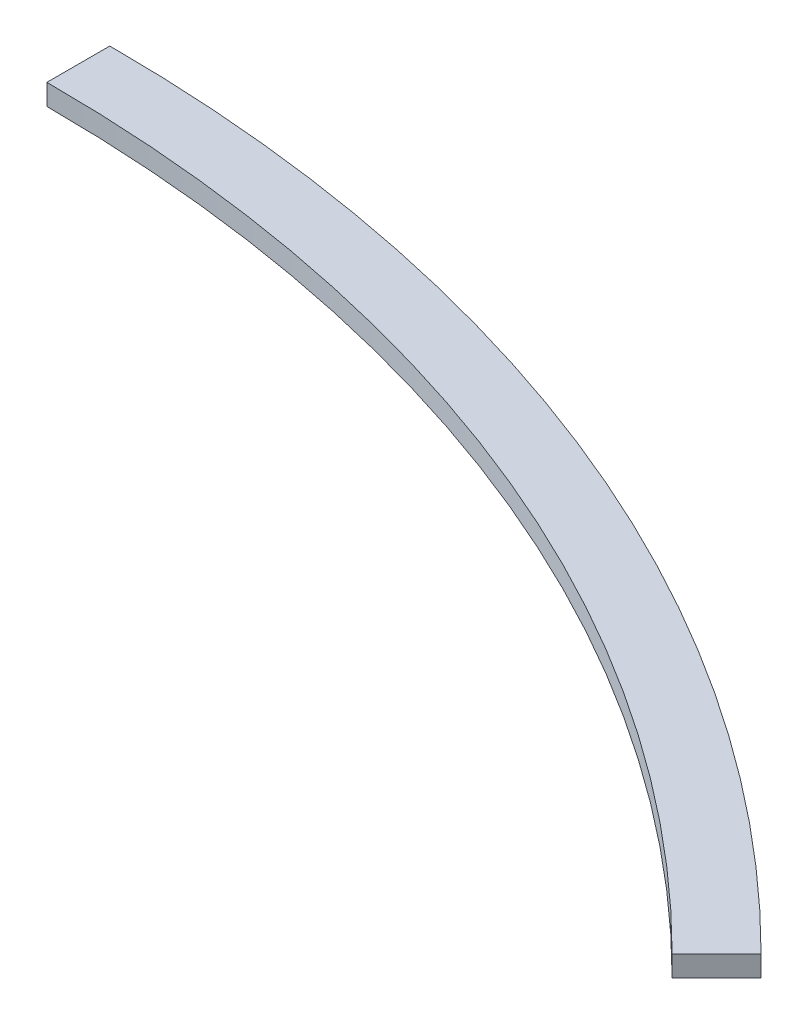
ISO-10303-21;
HEADER;
FILE_DESCRIPTION(('STEP AP214'),'2;1');
FILE_NAME('part.step','',(''),(''),'','','');
FILE_SCHEMA(('AUTOMOTIVE_DESIGN { 1 0 10303 214 1 1 1 1 }'));
ENDSEC;
DATA;
#1=APPLICATION_CONTEXT('core data for automotive mechanical design processes');
#2=APPLICATION_PROTOCOL_DEFINITION('international standard','automotive_design',2000,#1);
#3=PRODUCT_CONTEXT('',#1,'mechanical');
#4=PRODUCT('Part','Part','',(#3));
#5=PRODUCT_RELATED_PRODUCT_CATEGORY('part','',(#4));
#6=PRODUCT_DEFINITION_FORMATION('','',#4);
#7=PRODUCT_DEFINITION_CONTEXT('part definition',#1,'design');
#8=PRODUCT_DEFINITION('design','',#6,#7);
#9=PRODUCT_DEFINITION_SHAPE('','',#8);
#10=(LENGTH_UNIT() NAMED_UNIT(*) SI_UNIT(.MILLI.,.METRE.));
#11=(NAMED_UNIT(*) PLANE_ANGLE_UNIT() SI_UNIT($,.RADIAN.));
#12=(NAMED_UNIT(*) SI_UNIT($,.STERADIAN.) SOLID_ANGLE_UNIT());
#13=UNCERTAINTY_MEASURE_WITH_UNIT(LENGTH_MEASURE(1.E-05),#10,'distance_accuracy_value','');
#14=(GEOMETRIC_REPRESENTATION_CONTEXT(3) GLOBAL_UNCERTAINTY_ASSIGNED_CONTEXT((#13)) GLOBAL_UNIT_ASSIGNED_CONTEXT((#10,
#11,#12)) REPRESENTATION_CONTEXT('',''));
#15=CARTESIAN_POINT('',(0.,0.,0.));
#16=DIRECTION('',(0.,0.,1.));
#17=DIRECTION('',(1.,0.,0.));
#18=AXIS2_PLACEMENT_3D('',#15,#16,#17);
#19=CARTESIAN_POINT('',(0.,10.,0.));
#20=DIRECTION('',(0.,-1.,0.));
#21=DIRECTION('',(0.,0.,-1.));
#22=AXIS2_PLACEMENT_3D('',#19,#20,#21);
#23=CYLINDRICAL_SURFACE('',#22,720.);
#24=CARTESIAN_POINT('',(0.,0.,0.));
#25=DIRECTION('',(0.,-1.,0.));
#26=DIRECTION('',(0.,0.,-1.));
#27=AXIS2_PLACEMENT_3D('',#24,#25,#26);
#28=CIRCLE('',#27,720.);
#29=CARTESIAN_POINT('',(0.,0.,-720.));
#30=VERTEX_POINT('',#29);
#31=CARTESIAN_POINT('',(509.116882454315,0.,-509.116882454313));
#32=VERTEX_POINT('',#31);
#33=EDGE_CURVE('E95',#30,#32,#28,.T.);
#34=ORIENTED_EDGE('',*,*,#33,.T.);
#35=DIRECTION('',(0.,-1.,0.));
#36=VECTOR('',#35,1.);
#37=CARTESIAN_POINT('',(509.116882454315,10.,-509.116882454313));
#38=LINE('',#37,#36);
#39=CARTESIAN_POINT('',(509.116882454315,10.,-509.116882454313));
#40=VERTEX_POINT('',#39);
#41=EDGE_CURVE('E11',#40,#32,#38,.T.);
#42=ORIENTED_EDGE('',*,*,#41,.F.);
#43=CARTESIAN_POINT('',(0.,10.,0.));
#44=DIRECTION('',(0.,-1.,0.));
#45=DIRECTION('',(0.,0.,-1.));
#46=AXIS2_PLACEMENT_3D('',#43,#44,#45);
#47=CIRCLE('',#46,720.);
#48=CARTESIAN_POINT('',(0.,10.,-720.));
#49=VERTEX_POINT('',#48);
#50=EDGE_CURVE('E83',#49,#40,#47,.T.);
#51=ORIENTED_EDGE('',*,*,#50,.F.);
#52=DIRECTION('',(0.,-1.,0.));
#53=VECTOR('',#52,1.);
#54=CARTESIAN_POINT('',(0.,10.,-720.));
#55=LINE('',#54,#53);
#56=EDGE_CURVE('E91',#49,#30,#55,.T.);
#57=ORIENTED_EDGE('',*,*,#56,.T.);
#58=EDGE_LOOP('',(#34,#42,#51,#57));
#59=FACE_BOUND('',#58,.T.);
#60=ADVANCED_FACE('F32',(#59),#23,.F.);
#61=CARTESIAN_POINT('',(509.116882454315,10.,-509.116882454313));
#62=DIRECTION('',(-0.707106781186548,0.,-0.707106781186548));
#63=DIRECTION('',(-0.707106781186548,0.,0.707106781186548));
#64=AXIS2_PLACEMENT_3D('',#61,#62,#63);
#65=PLANE('',#64);
#66=DIRECTION('',(0.707106781186548,0.,-0.707106781186548));
#67=VECTOR('',#66,1.);
#68=CARTESIAN_POINT('',(509.116882454315,0.,-509.116882454313));
#69=LINE('',#68,#67);
#70=CARTESIAN_POINT('',(530.330085889912,0.,-530.33008588991));
#71=VERTEX_POINT('',#70);
#72=EDGE_CURVE('E87',#32,#71,#69,.T.);
#73=ORIENTED_EDGE('',*,*,#72,.T.);
#74=DIRECTION('',(0.,-1.,0.));
#75=VECTOR('',#74,1.);
#76=CARTESIAN_POINT('',(530.330085889912,10.,-530.33008588991));
#77=LINE('',#76,#75);
#78=CARTESIAN_POINT('',(530.330085889912,10.,-530.33008588991));
#79=VERTEX_POINT('',#78);
#80=EDGE_CURVE('E40',#79,#71,#77,.T.);
#81=ORIENTED_EDGE('',*,*,#80,.F.);
#82=DIRECTION('',(0.707106781186548,0.,-0.707106781186548));
#83=VECTOR('',#82,1.);
#84=CARTESIAN_POINT('',(509.116882454315,10.,-509.116882454313));
#85=LINE('',#84,#83);
#86=EDGE_CURVE('E78',#40,#79,#85,.T.);
#87=ORIENTED_EDGE('',*,*,#86,.F.);
#88=ORIENTED_EDGE('',*,*,#41,.T.);
#89=EDGE_LOOP('',(#73,#81,#87,#88));
#90=FACE_BOUND('',#89,.T.);
#91=ADVANCED_FACE('F86',(#90),#65,.F.);
#92=CARTESIAN_POINT('',(0.,10.,0.));
#93=DIRECTION('',(0.,-1.,0.));
#94=DIRECTION('',(0.,0.,-1.));
#95=AXIS2_PLACEMENT_3D('',#92,#93,#94);
#96=CYLINDRICAL_SURFACE('',#95,750.);
#97=CARTESIAN_POINT('',(0.,0.,0.));
#98=DIRECTION('',(0.,1.,0.));
#99=DIRECTION('',(0.,0.,-1.));
#100=AXIS2_PLACEMENT_3D('',#97,#98,#99);
#101=CIRCLE('',#100,750.);
#102=CARTESIAN_POINT('',(0.,0.,-750.));
#103=VERTEX_POINT('',#102);
#104=EDGE_CURVE('E65',#71,#103,#101,.T.);
#105=ORIENTED_EDGE('',*,*,#104,.T.);
#106=DIRECTION('',(0.,-1.,0.));
#107=VECTOR('',#106,1.);
#108=CARTESIAN_POINT('',(0.,10.,-750.));
#109=LINE('',#108,#107);
#110=CARTESIAN_POINT('',(0.,10.,-750.));
#111=VERTEX_POINT('',#110);
#112=EDGE_CURVE('E88',#111,#103,#109,.T.);
#113=ORIENTED_EDGE('',*,*,#112,.F.);
#114=CARTESIAN_POINT('',(0.,10.,0.));
#115=DIRECTION('',(0.,1.,0.));
#116=DIRECTION('',(0.,0.,-1.));
#117=AXIS2_PLACEMENT_3D('',#114,#115,#116);
#118=CIRCLE('',#117,750.);
#119=EDGE_CURVE('E81',#79,#111,#118,.T.);
#120=ORIENTED_EDGE('',*,*,#119,.F.);
#121=ORIENTED_EDGE('',*,*,#80,.T.);
#122=EDGE_LOOP('',(#105,#113,#120,#121));
#123=FACE_BOUND('',#122,.T.);
#124=ADVANCED_FACE('F89',(#123),#96,.T.);
#125=CARTESIAN_POINT('',(0.,10.,-720.));
#126=DIRECTION('',(1.,0.,0.));
#127=DIRECTION('',(0.,0.,-1.));
#128=AXIS2_PLACEMENT_3D('',#125,#126,#127);
#129=PLANE('',#128);
#130=DIRECTION('',(0.,0.,1.));
#131=VECTOR('',#130,1.);
#132=CARTESIAN_POINT('',(0.,0.,-720.));
#133=LINE('',#132,#131);
#134=EDGE_CURVE('E71',#103,#30,#133,.T.);
#135=ORIENTED_EDGE('',*,*,#134,.T.);
#136=ORIENTED_EDGE('',*,*,#56,.F.);
#137=DIRECTION('',(0.,0.,1.));
#138=VECTOR('',#137,1.);
#139=CARTESIAN_POINT('',(0.,10.,-720.));
#140=LINE('',#139,#138);
#141=EDGE_CURVE('E48',#111,#49,#140,.T.);
#142=ORIENTED_EDGE('',*,*,#141,.F.);
#143=ORIENTED_EDGE('',*,*,#112,.T.);
#144=EDGE_LOOP('',(#135,#136,#142,#143));
#145=FACE_BOUND('',#144,.T.);
#146=ADVANCED_FACE('F102',(#145),#129,.F.);
#147=CARTESIAN_POINT('',(0.,10.,0.));
#148=DIRECTION('',(0.,-1.,0.));
#149=DIRECTION('',(0.,0.,-1.));
#150=AXIS2_PLACEMENT_3D('',#147,#148,#149);
#151=PLANE('',#150);
#152=ORIENTED_EDGE('',*,*,#50,.T.);
#153=ORIENTED_EDGE('',*,*,#86,.T.);
#154=ORIENTED_EDGE('',*,*,#119,.T.);
#155=ORIENTED_EDGE('',*,*,#141,.T.);
#156=EDGE_LOOP('',(#152,#153,#154,#155));
#157=FACE_BOUND('',#156,.T.);
#158=ADVANCED_FACE('F79',(#157),#151,.F.);
#159=CARTESIAN_POINT('',(0.,0.,0.));
#160=DIRECTION('',(0.,-1.,0.));
#161=DIRECTION('',(0.,0.,-1.));
#162=AXIS2_PLACEMENT_3D('',#159,#160,#161);
#163=PLANE('',#162);
#164=ORIENTED_EDGE('',*,*,#33,.F.);
#165=ORIENTED_EDGE('',*,*,#134,.F.);
#166=ORIENTED_EDGE('',*,*,#104,.F.);
#167=ORIENTED_EDGE('',*,*,#72,.F.);
#168=EDGE_LOOP('',(#164,#165,#166,#167));
#169=FACE_BOUND('',#168,.T.);
#170=ADVANCED_FACE('F105',(#169),#163,.T.);
#171=CLOSED_SHELL('',(#60,#91,#124,#146,#158,#170));
#172=MANIFOLD_SOLID_BREP('B2',#171);
#173=ADVANCED_BREP_SHAPE_REPRESENTATION('',(#18,#172),#14);
#174=SHAPE_DEFINITION_REPRESENTATION(#9,#173);
ENDSEC;
END-ISO-10303-21;
